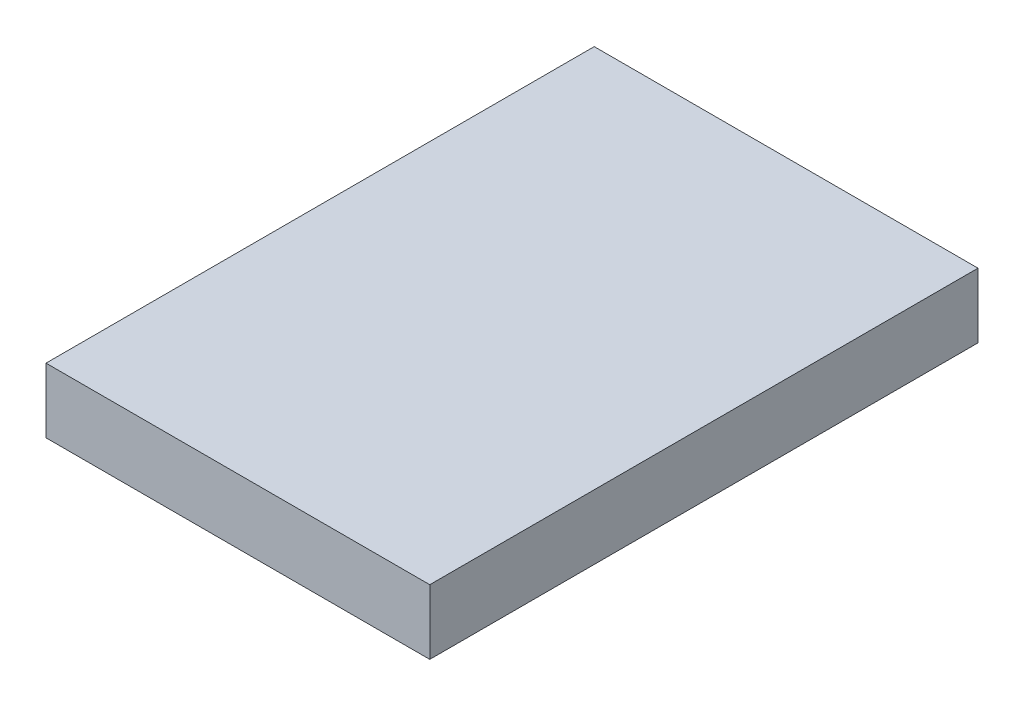
ISO-10303-21;
HEADER;
FILE_DESCRIPTION(('STEP AP214'),'2;1');
FILE_NAME('part.step','',(''),(''),'','','');
FILE_SCHEMA(('AUTOMOTIVE_DESIGN { 1 0 10303 214 1 1 1 1 }'));
ENDSEC;
DATA;
#1=APPLICATION_CONTEXT('core data for automotive mechanical design processes');
#2=APPLICATION_PROTOCOL_DEFINITION('international standard','automotive_design',2000,#1);
#3=PRODUCT_CONTEXT('',#1,'mechanical');
#4=PRODUCT('Part','Part','',(#3));
#5=PRODUCT_RELATED_PRODUCT_CATEGORY('part','',(#4));
#6=PRODUCT_DEFINITION_FORMATION('','',#4);
#7=PRODUCT_DEFINITION_CONTEXT('part definition',#1,'design');
#8=PRODUCT_DEFINITION('design','',#6,#7);
#9=PRODUCT_DEFINITION_SHAPE('','',#8);
#10=(LENGTH_UNIT() NAMED_UNIT(*) SI_UNIT(.MILLI.,.METRE.));
#11=(NAMED_UNIT(*) PLANE_ANGLE_UNIT() SI_UNIT($,.RADIAN.));
#12=(NAMED_UNIT(*) SI_UNIT($,.STERADIAN.) SOLID_ANGLE_UNIT());
#13=UNCERTAINTY_MEASURE_WITH_UNIT(LENGTH_MEASURE(1.E-05),#10,'distance_accuracy_value','');
#14=(GEOMETRIC_REPRESENTATION_CONTEXT(3) GLOBAL_UNCERTAINTY_ASSIGNED_CONTEXT((#13)) GLOBAL_UNIT_ASSIGNED_CONTEXT((#10,
#11,#12)) REPRESENTATION_CONTEXT('',''));
#15=CARTESIAN_POINT('',(0.,0.,0.));
#16=DIRECTION('',(0.,0.,1.));
#17=DIRECTION('',(1.,0.,0.));
#18=AXIS2_PLACEMENT_3D('',#15,#16,#17);
#19=CARTESIAN_POINT('',(7.00000000000002,2.36,-9.99999999999999));
#20=DIRECTION('',(-1.,0.,0.));
#21=DIRECTION('',(0.,0.,1.));
#22=AXIS2_PLACEMENT_3D('',#19,#20,#21);
#23=PLANE('',#22);
#24=DIRECTION('',(0.,0.,-1.));
#25=VECTOR('',#24,1.);
#26=CARTESIAN_POINT('',(7.00000000000002,0.,-9.99999999999999));
#27=LINE('',#26,#25);
#28=CARTESIAN_POINT('',(7.00000000000002,0.,10.));
#29=VERTEX_POINT('',#28);
#30=CARTESIAN_POINT('',(7.00000000000002,0.,-9.99999999999999));
#31=VERTEX_POINT('',#30);
#32=EDGE_CURVE('E96',#29,#31,#27,.T.);
#33=ORIENTED_EDGE('',*,*,#32,.T.);
#34=DIRECTION('',(0.,-1.,0.));
#35=VECTOR('',#34,1.);
#36=CARTESIAN_POINT('',(7.00000000000002,2.36,-9.99999999999999));
#37=LINE('',#36,#35);
#38=CARTESIAN_POINT('',(7.00000000000002,2.36,-9.99999999999999));
#39=VERTEX_POINT('',#38);
#40=EDGE_CURVE('E11',#39,#31,#37,.T.);
#41=ORIENTED_EDGE('',*,*,#40,.F.);
#42=DIRECTION('',(0.,0.,-1.));
#43=VECTOR('',#42,1.);
#44=CARTESIAN_POINT('',(7.00000000000002,2.36,-9.99999999999999));
#45=LINE('',#44,#43);
#46=CARTESIAN_POINT('',(7.00000000000002,2.36,10.));
#47=VERTEX_POINT('',#46);
#48=EDGE_CURVE('E84',#47,#39,#45,.T.);
#49=ORIENTED_EDGE('',*,*,#48,.F.);
#50=DIRECTION('',(0.,-1.,0.));
#51=VECTOR('',#50,1.);
#52=CARTESIAN_POINT('',(7.00000000000002,2.36,10.));
#53=LINE('',#52,#51);
#54=EDGE_CURVE('E92',#47,#29,#53,.T.);
#55=ORIENTED_EDGE('',*,*,#54,.T.);
#56=EDGE_LOOP('',(#33,#41,#49,#55));
#57=FACE_BOUND('',#56,.T.);
#58=ADVANCED_FACE('F33',(#57),#23,.F.);
#59=CARTESIAN_POINT('',(-6.99999999999998,2.36,-9.99999999999999));
#60=DIRECTION('',(0.,0.,1.));
#61=DIRECTION('',(1.,0.,0.));
#62=AXIS2_PLACEMENT_3D('',#59,#60,#61);
#63=PLANE('',#62);
#64=DIRECTION('',(-1.,0.,0.));
#65=VECTOR('',#64,1.);
#66=CARTESIAN_POINT('',(-6.99999999999998,0.,-9.99999999999999));
#67=LINE('',#66,#65);
#68=CARTESIAN_POINT('',(-6.99999999999998,0.,-9.99999999999999));
#69=VERTEX_POINT('',#68);
#70=EDGE_CURVE('E88',#31,#69,#67,.T.);
#71=ORIENTED_EDGE('',*,*,#70,.T.);
#72=DIRECTION('',(0.,-1.,0.));
#73=VECTOR('',#72,1.);
#74=CARTESIAN_POINT('',(-6.99999999999998,2.36,-9.99999999999999));
#75=LINE('',#74,#73);
#76=CARTESIAN_POINT('',(-6.99999999999998,2.36,-9.99999999999999));
#77=VERTEX_POINT('',#76);
#78=EDGE_CURVE('E41',#77,#69,#75,.T.);
#79=ORIENTED_EDGE('',*,*,#78,.F.);
#80=DIRECTION('',(-1.,0.,0.));
#81=VECTOR('',#80,1.);
#82=CARTESIAN_POINT('',(-6.99999999999998,2.36,-9.99999999999999));
#83=LINE('',#82,#81);
#84=EDGE_CURVE('E79',#39,#77,#83,.T.);
#85=ORIENTED_EDGE('',*,*,#84,.F.);
#86=ORIENTED_EDGE('',*,*,#40,.T.);
#87=EDGE_LOOP('',(#71,#79,#85,#86));
#88=FACE_BOUND('',#87,.T.);
#89=ADVANCED_FACE('F87',(#88),#63,.F.);
#90=CARTESIAN_POINT('',(-6.99999999999998,2.36,-9.99999999999999));
#91=DIRECTION('',(1.,0.,0.));
#92=DIRECTION('',(0.,0.,-1.));
#93=AXIS2_PLACEMENT_3D('',#90,#91,#92);
#94=PLANE('',#93);
#95=DIRECTION('',(0.,0.,1.));
#96=VECTOR('',#95,1.);
#97=CARTESIAN_POINT('',(-6.99999999999998,0.,-9.99999999999999));
#98=LINE('',#97,#96);
#99=CARTESIAN_POINT('',(-6.99999999999998,0.,10.));
#100=VERTEX_POINT('',#99);
#101=EDGE_CURVE('E66',#69,#100,#98,.T.);
#102=ORIENTED_EDGE('',*,*,#101,.T.);
#103=DIRECTION('',(0.,-1.,0.));
#104=VECTOR('',#103,1.);
#105=CARTESIAN_POINT('',(-6.99999999999998,2.36,10.));
#106=LINE('',#105,#104);
#107=CARTESIAN_POINT('',(-6.99999999999998,2.36,10.));
#108=VERTEX_POINT('',#107);
#109=EDGE_CURVE('E89',#108,#100,#106,.T.);
#110=ORIENTED_EDGE('',*,*,#109,.F.);
#111=DIRECTION('',(0.,0.,1.));
#112=VECTOR('',#111,1.);
#113=CARTESIAN_POINT('',(-6.99999999999998,2.36,-9.99999999999999));
#114=LINE('',#113,#112);
#115=EDGE_CURVE('E82',#77,#108,#114,.T.);
#116=ORIENTED_EDGE('',*,*,#115,.F.);
#117=ORIENTED_EDGE('',*,*,#78,.T.);
#118=EDGE_LOOP('',(#102,#110,#116,#117));
#119=FACE_BOUND('',#118,.T.);
#120=ADVANCED_FACE('F90',(#119),#94,.F.);
#121=CARTESIAN_POINT('',(-6.99999999999998,2.36,10.));
#122=DIRECTION('',(0.,0.,-1.));
#123=DIRECTION('',(-1.,0.,0.));
#124=AXIS2_PLACEMENT_3D('',#121,#122,#123);
#125=PLANE('',#124);
#126=DIRECTION('',(1.,0.,0.));
#127=VECTOR('',#126,1.);
#128=CARTESIAN_POINT('',(-6.99999999999998,0.,10.));
#129=LINE('',#128,#127);
#130=EDGE_CURVE('E72',#100,#29,#129,.T.);
#131=ORIENTED_EDGE('',*,*,#130,.T.);
#132=ORIENTED_EDGE('',*,*,#54,.F.);
#133=DIRECTION('',(1.,0.,0.));
#134=VECTOR('',#133,1.);
#135=CARTESIAN_POINT('',(-6.99999999999998,2.36,10.));
#136=LINE('',#135,#134);
#137=EDGE_CURVE('E49',#108,#47,#136,.T.);
#138=ORIENTED_EDGE('',*,*,#137,.F.);
#139=ORIENTED_EDGE('',*,*,#109,.T.);
#140=EDGE_LOOP('',(#131,#132,#138,#139));
#141=FACE_BOUND('',#140,.T.);
#142=ADVANCED_FACE('F103',(#141),#125,.F.);
#143=CARTESIAN_POINT('',(0.,2.36,0.));
#144=DIRECTION('',(0.,1.,0.));
#145=DIRECTION('',(0.,0.,1.));
#146=AXIS2_PLACEMENT_3D('',#143,#144,#145);
#147=PLANE('',#146);
#148=ORIENTED_EDGE('',*,*,#48,.T.);
#149=ORIENTED_EDGE('',*,*,#84,.T.);
#150=ORIENTED_EDGE('',*,*,#115,.T.);
#151=ORIENTED_EDGE('',*,*,#137,.T.);
#152=EDGE_LOOP('',(#148,#149,#150,#151));
#153=FACE_BOUND('',#152,.T.);
#154=ADVANCED_FACE('F80',(#153),#147,.T.);
#155=CARTESIAN_POINT('',(0.,0.,0.));
#156=DIRECTION('',(0.,1.,0.));
#157=DIRECTION('',(0.,0.,1.));
#158=AXIS2_PLACEMENT_3D('',#155,#156,#157);
#159=PLANE('',#158);
#160=ORIENTED_EDGE('',*,*,#32,.F.);
#161=ORIENTED_EDGE('',*,*,#130,.F.);
#162=ORIENTED_EDGE('',*,*,#101,.F.);
#163=ORIENTED_EDGE('',*,*,#70,.F.);
#164=EDGE_LOOP('',(#160,#161,#162,#163));
#165=FACE_BOUND('',#164,.T.);
#166=ADVANCED_FACE('F106',(#165),#159,.F.);
#167=CLOSED_SHELL('',(#58,#89,#120,#142,#154,#166));
#168=MANIFOLD_SOLID_BREP('B2',#167);
#169=ADVANCED_BREP_SHAPE_REPRESENTATION('',(#18,#168),#14);
#170=SHAPE_DEFINITION_REPRESENTATION(#9,#169);
ENDSEC;
END-ISO-10303-21;
